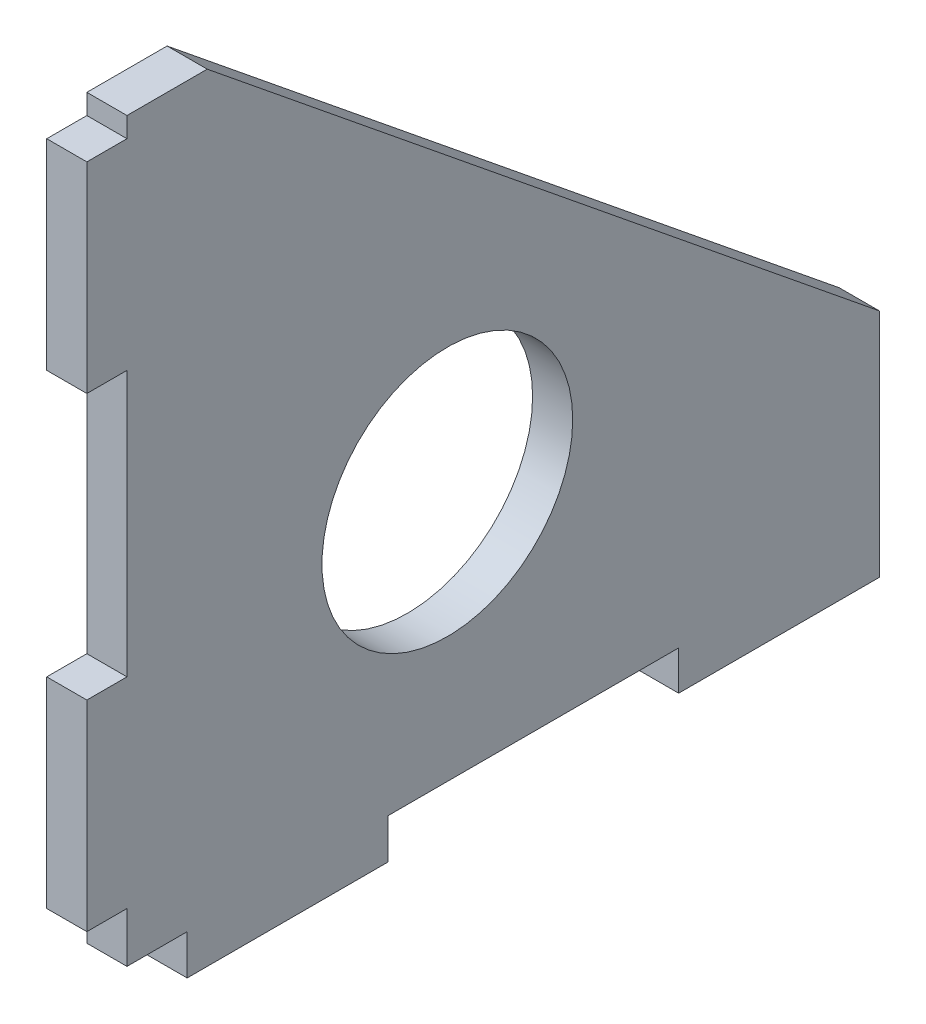
ISO-10303-21;
HEADER;
FILE_DESCRIPTION(('STEP AP214'),'2;1');
FILE_NAME('part.step','',(''),(''),'','','');
FILE_SCHEMA(('AUTOMOTIVE_DESIGN { 1 0 10303 214 1 1 1 1 }'));
ENDSEC;
DATA;
#1=APPLICATION_CONTEXT('core data for automotive mechanical design processes');
#2=APPLICATION_PROTOCOL_DEFINITION('international standard','automotive_design',2000,#1);
#3=PRODUCT_CONTEXT('',#1,'mechanical');
#4=PRODUCT('Part','Part','',(#3));
#5=PRODUCT_RELATED_PRODUCT_CATEGORY('part','',(#4));
#6=PRODUCT_DEFINITION_FORMATION('','',#4);
#7=PRODUCT_DEFINITION_CONTEXT('part definition',#1,'design');
#8=PRODUCT_DEFINITION('design','',#6,#7);
#9=PRODUCT_DEFINITION_SHAPE('','',#8);
#10=(LENGTH_UNIT() NAMED_UNIT(*) SI_UNIT(.MILLI.,.METRE.));
#11=(NAMED_UNIT(*) PLANE_ANGLE_UNIT() SI_UNIT($,.RADIAN.));
#12=(NAMED_UNIT(*) SI_UNIT($,.STERADIAN.) SOLID_ANGLE_UNIT());
#13=UNCERTAINTY_MEASURE_WITH_UNIT(LENGTH_MEASURE(1.E-05),#10,'distance_accuracy_value','');
#14=(GEOMETRIC_REPRESENTATION_CONTEXT(3) GLOBAL_UNCERTAINTY_ASSIGNED_CONTEXT((#13)) GLOBAL_UNIT_ASSIGNED_CONTEXT((#10,
#11,#12)) REPRESENTATION_CONTEXT('',''));
#15=CARTESIAN_POINT('',(0.,0.,0.));
#16=DIRECTION('',(0.,0.,1.));
#17=DIRECTION('',(1.,0.,0.));
#18=AXIS2_PLACEMENT_3D('',#15,#16,#17);
#19=CARTESIAN_POINT('',(4.,0.,0.));
#20=DIRECTION('',(-1.,0.,0.));
#21=DIRECTION('',(0.,0.,1.));
#22=AXIS2_PLACEMENT_3D('',#19,#20,#21);
#23=PLANE('',#22);
#24=DIRECTION('',(0.,0.,1.));
#25=VECTOR('',#24,1.);
#26=CARTESIAN_POINT('',(4.,34.0529513228353,32.145071830835));
#27=LINE('',#26,#25);
#28=CARTESIAN_POINT('',(4.,34.0529513228353,28.145071830835));
#29=VERTEX_POINT('',#28);
#30=CARTESIAN_POINT('',(4.,34.0529513228353,32.145071830835));
#31=VERTEX_POINT('',#30);
#32=EDGE_CURVE('E234',#29,#31,#27,.T.);
#33=ORIENTED_EDGE('',*,*,#32,.T.);
#34=DIRECTION('',(0.,-1.,0.));
#35=VECTOR('',#34,1.);
#36=CARTESIAN_POINT('',(4.,34.0529513228353,32.145071830835));
#37=LINE('',#36,#35);
#38=CARTESIAN_POINT('',(4.,14.0529513228353,32.145071830835));
#39=VERTEX_POINT('',#38);
#40=EDGE_CURVE('E127',#31,#39,#37,.T.);
#41=ORIENTED_EDGE('',*,*,#40,.T.);
#42=DIRECTION('',(0.,0.,-1.));
#43=VECTOR('',#42,1.);
#44=CARTESIAN_POINT('',(4.,14.0529513228353,32.145071830835));
#45=LINE('',#44,#43);
#46=CARTESIAN_POINT('',(4.,14.0529513228353,28.145071830835));
#47=VERTEX_POINT('',#46);
#48=EDGE_CURVE('E282',#39,#47,#45,.T.);
#49=ORIENTED_EDGE('',*,*,#48,.T.);
#50=DIRECTION('',(0.,-1.,0.));
#51=VECTOR('',#50,1.);
#52=CARTESIAN_POINT('',(4.,14.0529513228353,28.145071830835));
#53=LINE('',#52,#51);
#54=CARTESIAN_POINT('',(4.,-12.4097906933287,28.145071830835));
#55=VERTEX_POINT('',#54);
#56=EDGE_CURVE('E301',#47,#55,#53,.T.);
#57=ORIENTED_EDGE('',*,*,#56,.T.);
#58=DIRECTION('',(0.,0.,1.));
#59=VECTOR('',#58,1.);
#60=CARTESIAN_POINT('',(4.,-12.4097906933287,28.145071830835));
#61=LINE('',#60,#59);
#62=CARTESIAN_POINT('',(4.,-12.4097906933287,32.145071830835));
#63=VERTEX_POINT('',#62);
#64=EDGE_CURVE('E298',#55,#63,#61,.T.);
#65=ORIENTED_EDGE('',*,*,#64,.T.);
#66=DIRECTION('',(0.,-1.,0.));
#67=VECTOR('',#66,1.);
#68=CARTESIAN_POINT('',(4.,-12.4097906933287,32.145071830835));
#69=LINE('',#68,#67);
#70=CARTESIAN_POINT('',(4.,-32.4097906933287,32.145071830835));
#71=VERTEX_POINT('',#70);
#72=EDGE_CURVE('E300',#63,#71,#69,.T.);
#73=ORIENTED_EDGE('',*,*,#72,.T.);
#74=DIRECTION('',(0.,0.,-1.));
#75=VECTOR('',#74,1.);
#76=CARTESIAN_POINT('',(4.,-32.4097906933287,32.145071830835));
#77=LINE('',#76,#75);
#78=CARTESIAN_POINT('',(4.,-32.4097906933287,28.145071830835));
#79=VERTEX_POINT('',#78);
#80=EDGE_CURVE('E303',#71,#79,#77,.T.);
#81=ORIENTED_EDGE('',*,*,#80,.T.);
#82=DIRECTION('',(0.,-1.,0.));
#83=VECTOR('',#82,1.);
#84=CARTESIAN_POINT('',(4.,-32.4097906933287,28.145071830835));
#85=LINE('',#84,#83);
#86=CARTESIAN_POINT('',(4.,-37.4097906933287,28.145071830835));
#87=VERTEX_POINT('',#86);
#88=EDGE_CURVE('E309',#79,#87,#85,.T.);
#89=ORIENTED_EDGE('',*,*,#88,.T.);
#90=DIRECTION('',(0.,0.,-1.));
#91=VECTOR('',#90,1.);
#92=CARTESIAN_POINT('',(4.,-37.4097906933287,28.145071830835));
#93=LINE('',#92,#91);
#94=CARTESIAN_POINT('',(4.,-37.4097906933287,22.145071830835));
#95=VERTEX_POINT('',#94);
#96=EDGE_CURVE('E311',#87,#95,#93,.T.);
#97=ORIENTED_EDGE('',*,*,#96,.T.);
#98=DIRECTION('',(0.,-1.,0.));
#99=VECTOR('',#98,1.);
#100=CARTESIAN_POINT('',(4.,-37.4097906933287,22.145071830835));
#101=LINE('',#100,#99);
#102=CARTESIAN_POINT('',(4.,-41.4097906933287,22.145071830835));
#103=VERTEX_POINT('',#102);
#104=EDGE_CURVE('E313',#95,#103,#101,.T.);
#105=ORIENTED_EDGE('',*,*,#104,.T.);
#106=DIRECTION('',(0.,0.,-1.));
#107=VECTOR('',#106,1.);
#108=CARTESIAN_POINT('',(4.,-41.4097906933287,22.145071830835));
#109=LINE('',#108,#107);
#110=CARTESIAN_POINT('',(4.,-41.4097906933287,2.14507183083501));
#111=VERTEX_POINT('',#110);
#112=EDGE_CURVE('E315',#103,#111,#109,.T.);
#113=ORIENTED_EDGE('',*,*,#112,.T.);
#114=DIRECTION('',(0.,1.,0.));
#115=VECTOR('',#114,1.);
#116=CARTESIAN_POINT('',(4.,-41.4097906933287,2.14507183083501));
#117=LINE('',#116,#115);
#118=CARTESIAN_POINT('',(4.,-37.4097906933287,2.14507183083501));
#119=VERTEX_POINT('',#118);
#120=EDGE_CURVE('E317',#111,#119,#117,.T.);
#121=ORIENTED_EDGE('',*,*,#120,.T.);
#122=DIRECTION('',(0.,0.,-1.));
#123=VECTOR('',#122,1.);
#124=CARTESIAN_POINT('',(4.,-37.4097906933287,2.14507183083501));
#125=LINE('',#124,#123);
#126=CARTESIAN_POINT('',(4.,-37.4097906933287,-26.854928169165));
#127=VERTEX_POINT('',#126);
#128=EDGE_CURVE('E319',#119,#127,#125,.T.);
#129=ORIENTED_EDGE('',*,*,#128,.T.);
#130=DIRECTION('',(0.,-1.,0.));
#131=VECTOR('',#130,1.);
#132=CARTESIAN_POINT('',(4.,-37.4097906933287,-26.854928169165));
#133=LINE('',#132,#131);
#134=CARTESIAN_POINT('',(4.,-41.3226718184951,-26.854928169165));
#135=VERTEX_POINT('',#134);
#136=EDGE_CURVE('E321',#127,#135,#133,.T.);
#137=ORIENTED_EDGE('',*,*,#136,.T.);
#138=DIRECTION('',(0.,0.,-1.));
#139=VECTOR('',#138,1.);
#140=CARTESIAN_POINT('',(4.,-41.3226718184951,-26.854928169165));
#141=LINE('',#140,#139);
#142=CARTESIAN_POINT('',(4.,-41.3226718184951,-46.854928169165));
#143=VERTEX_POINT('',#142);
#144=EDGE_CURVE('E323',#135,#143,#141,.T.);
#145=ORIENTED_EDGE('',*,*,#144,.T.);
#146=DIRECTION('',(0.,1.,0.));
#147=VECTOR('',#146,1.);
#148=CARTESIAN_POINT('',(4.,-41.3226718184951,-46.854928169165));
#149=LINE('',#148,#147);
#150=CARTESIAN_POINT('',(4.,-18.3086322954986,-46.854928169165));
#151=VERTEX_POINT('',#150);
#152=EDGE_CURVE('E179',#143,#151,#149,.T.);
#153=ORIENTED_EDGE('',*,*,#152,.T.);
#154=DIRECTION('',(0.,0.630091001553816,0.776521300262207));
#155=VECTOR('',#154,1.);
#156=CARTESIAN_POINT('',(4.,-18.3086322954986,-46.854928169165));
#157=LINE('',#156,#155);
#158=CARTESIAN_POINT('',(4.,36.0570329990022,20.145071830835));
#159=VERTEX_POINT('',#158);
#160=EDGE_CURVE('E173',#151,#159,#157,.T.);
#161=ORIENTED_EDGE('',*,*,#160,.T.);
#162=DIRECTION('',(0.,0.,1.));
#163=VECTOR('',#162,1.);
#164=CARTESIAN_POINT('',(4.,36.0570329990022,28.145071830835));
#165=LINE('',#164,#163);
#166=CARTESIAN_POINT('',(4.,36.0570329990022,28.145071830835));
#167=VERTEX_POINT('',#166);
#168=EDGE_CURVE('E177',#159,#167,#165,.T.);
#169=ORIENTED_EDGE('',*,*,#168,.T.);
#170=DIRECTION('',(0.,-1.,0.));
#171=VECTOR('',#170,1.);
#172=CARTESIAN_POINT('',(4.,36.0570329990022,28.145071830835));
#173=LINE('',#172,#171);
#174=EDGE_CURVE('E51',#167,#29,#173,.T.);
#175=ORIENTED_EDGE('',*,*,#174,.T.);
#176=EDGE_LOOP('',(#33,#41,#49,#57,#65,#73,#81,#89,#97,#105,#113,#121,#129,#137,#145,#153,#161,
#169,#175));
#177=FACE_BOUND('',#176,.T.);
#178=CARTESIAN_POINT('',(4.,-12.4097906933287,-3.79377047219465));
#179=DIRECTION('',(1.,0.,0.));
#180=DIRECTION('',(0.,0.,-1.));
#181=AXIS2_PLACEMENT_3D('',#178,#179,#180);
#182=CIRCLE('',#181,12.5);
#183=CARTESIAN_POINT('',(4.,-12.4097906933287,-16.2937704721947));
#184=VERTEX_POINT('',#183);
#185=EDGE_CURVE('E201',#184,#184,#182,.T.);
#186=ORIENTED_EDGE('',*,*,#185,.F.);
#187=EDGE_LOOP('',(#186));
#188=FACE_BOUND('',#187,.T.);
#189=ADVANCED_FACE('F34',(#177,#188),#23,.F.);
#190=CARTESIAN_POINT('',(0.,0.,0.));
#191=DIRECTION('',(-1.,0.,0.));
#192=DIRECTION('',(0.,0.,1.));
#193=AXIS2_PLACEMENT_3D('',#190,#191,#192);
#194=PLANE('',#193);
#195=DIRECTION('',(0.,0.,1.));
#196=VECTOR('',#195,1.);
#197=CARTESIAN_POINT('',(0.,34.0529513228353,32.145071830835));
#198=LINE('',#197,#196);
#199=CARTESIAN_POINT('',(0.,34.0529513228353,28.145071830835));
#200=VERTEX_POINT('',#199);
#201=CARTESIAN_POINT('',(0.,34.0529513228353,32.145071830835));
#202=VERTEX_POINT('',#201);
#203=EDGE_CURVE('E197',#200,#202,#198,.T.);
#204=ORIENTED_EDGE('',*,*,#203,.F.);
#205=DIRECTION('',(0.,-1.,0.));
#206=VECTOR('',#205,1.);
#207=CARTESIAN_POINT('',(0.,36.0570329990022,28.145071830835));
#208=LINE('',#207,#206);
#209=CARTESIAN_POINT('',(0.,36.0570329990022,28.145071830835));
#210=VERTEX_POINT('',#209);
#211=EDGE_CURVE('E119',#210,#200,#208,.T.);
#212=ORIENTED_EDGE('',*,*,#211,.F.);
#213=DIRECTION('',(0.,0.,1.));
#214=VECTOR('',#213,1.);
#215=CARTESIAN_POINT('',(0.,36.0570329990022,28.145071830835));
#216=LINE('',#215,#214);
#217=CARTESIAN_POINT('',(0.,36.0570329990022,20.145071830835));
#218=VERTEX_POINT('',#217);
#219=EDGE_CURVE('E113',#218,#210,#216,.T.);
#220=ORIENTED_EDGE('',*,*,#219,.F.);
#221=DIRECTION('',(0.,0.630091001553816,0.776521300262207));
#222=VECTOR('',#221,1.);
#223=CARTESIAN_POINT('',(0.,-18.3086322954986,-46.854928169165));
#224=LINE('',#223,#222);
#225=CARTESIAN_POINT('',(0.,-18.3086322954986,-46.854928169165));
#226=VERTEX_POINT('',#225);
#227=EDGE_CURVE('E187',#226,#218,#224,.T.);
#228=ORIENTED_EDGE('',*,*,#227,.F.);
#229=DIRECTION('',(0.,1.,0.));
#230=VECTOR('',#229,1.);
#231=CARTESIAN_POINT('',(0.,-41.3226718184951,-46.854928169165));
#232=LINE('',#231,#230);
#233=CARTESIAN_POINT('',(0.,-41.3226718184951,-46.854928169165));
#234=VERTEX_POINT('',#233);
#235=EDGE_CURVE('E229',#234,#226,#232,.T.);
#236=ORIENTED_EDGE('',*,*,#235,.F.);
#237=DIRECTION('',(0.,0.,-1.));
#238=VECTOR('',#237,1.);
#239=CARTESIAN_POINT('',(0.,-41.3226718184951,-26.854928169165));
#240=LINE('',#239,#238);
#241=CARTESIAN_POINT('',(0.,-41.3226718184951,-26.854928169165));
#242=VERTEX_POINT('',#241);
#243=EDGE_CURVE('E227',#242,#234,#240,.T.);
#244=ORIENTED_EDGE('',*,*,#243,.F.);
#245=DIRECTION('',(0.,-1.,0.));
#246=VECTOR('',#245,1.);
#247=CARTESIAN_POINT('',(0.,-37.4097906933287,-26.854928169165));
#248=LINE('',#247,#246);
#249=CARTESIAN_POINT('',(0.,-37.4097906933287,-26.854928169165));
#250=VERTEX_POINT('',#249);
#251=EDGE_CURVE('E225',#250,#242,#248,.T.);
#252=ORIENTED_EDGE('',*,*,#251,.F.);
#253=DIRECTION('',(0.,0.,-1.));
#254=VECTOR('',#253,1.);
#255=CARTESIAN_POINT('',(0.,-37.4097906933287,2.14507183083501));
#256=LINE('',#255,#254);
#257=CARTESIAN_POINT('',(0.,-37.4097906933287,2.14507183083501));
#258=VERTEX_POINT('',#257);
#259=EDGE_CURVE('E223',#258,#250,#256,.T.);
#260=ORIENTED_EDGE('',*,*,#259,.F.);
#261=DIRECTION('',(0.,1.,0.));
#262=VECTOR('',#261,1.);
#263=CARTESIAN_POINT('',(0.,-41.4097906933287,2.14507183083501));
#264=LINE('',#263,#262);
#265=CARTESIAN_POINT('',(0.,-41.4097906933287,2.14507183083501));
#266=VERTEX_POINT('',#265);
#267=EDGE_CURVE('E221',#266,#258,#264,.T.);
#268=ORIENTED_EDGE('',*,*,#267,.F.);
#269=DIRECTION('',(0.,0.,-1.));
#270=VECTOR('',#269,1.);
#271=CARTESIAN_POINT('',(0.,-41.4097906933287,22.145071830835));
#272=LINE('',#271,#270);
#273=CARTESIAN_POINT('',(0.,-41.4097906933287,22.145071830835));
#274=VERTEX_POINT('',#273);
#275=EDGE_CURVE('E219',#274,#266,#272,.T.);
#276=ORIENTED_EDGE('',*,*,#275,.F.);
#277=DIRECTION('',(0.,-1.,0.));
#278=VECTOR('',#277,1.);
#279=CARTESIAN_POINT('',(0.,-37.4097906933287,22.145071830835));
#280=LINE('',#279,#278);
#281=CARTESIAN_POINT('',(0.,-37.4097906933287,22.145071830835));
#282=VERTEX_POINT('',#281);
#283=EDGE_CURVE('E217',#282,#274,#280,.T.);
#284=ORIENTED_EDGE('',*,*,#283,.F.);
#285=DIRECTION('',(0.,0.,-1.));
#286=VECTOR('',#285,1.);
#287=CARTESIAN_POINT('',(0.,-37.4097906933287,28.145071830835));
#288=LINE('',#287,#286);
#289=CARTESIAN_POINT('',(0.,-37.4097906933287,28.145071830835));
#290=VERTEX_POINT('',#289);
#291=EDGE_CURVE('E215',#290,#282,#288,.T.);
#292=ORIENTED_EDGE('',*,*,#291,.F.);
#293=DIRECTION('',(0.,-1.,0.));
#294=VECTOR('',#293,1.);
#295=CARTESIAN_POINT('',(0.,-32.4097906933287,28.145071830835));
#296=LINE('',#295,#294);
#297=CARTESIAN_POINT('',(0.,-32.4097906933287,28.145071830835));
#298=VERTEX_POINT('',#297);
#299=EDGE_CURVE('E213',#298,#290,#296,.T.);
#300=ORIENTED_EDGE('',*,*,#299,.F.);
#301=DIRECTION('',(0.,0.,-1.));
#302=VECTOR('',#301,1.);
#303=CARTESIAN_POINT('',(0.,-32.4097906933287,32.145071830835));
#304=LINE('',#303,#302);
#305=CARTESIAN_POINT('',(0.,-32.4097906933287,32.145071830835));
#306=VERTEX_POINT('',#305);
#307=EDGE_CURVE('E211',#306,#298,#304,.T.);
#308=ORIENTED_EDGE('',*,*,#307,.F.);
#309=DIRECTION('',(0.,-1.,0.));
#310=VECTOR('',#309,1.);
#311=CARTESIAN_POINT('',(0.,-12.4097906933287,32.145071830835));
#312=LINE('',#311,#310);
#313=CARTESIAN_POINT('',(0.,-12.4097906933287,32.145071830835));
#314=VERTEX_POINT('',#313);
#315=EDGE_CURVE('E209',#314,#306,#312,.T.);
#316=ORIENTED_EDGE('',*,*,#315,.F.);
#317=DIRECTION('',(0.,0.,1.));
#318=VECTOR('',#317,1.);
#319=CARTESIAN_POINT('',(0.,-12.4097906933287,28.145071830835));
#320=LINE('',#319,#318);
#321=CARTESIAN_POINT('',(0.,-12.4097906933287,28.145071830835));
#322=VERTEX_POINT('',#321);
#323=EDGE_CURVE('E207',#322,#314,#320,.T.);
#324=ORIENTED_EDGE('',*,*,#323,.F.);
#325=DIRECTION('',(0.,-1.,0.));
#326=VECTOR('',#325,1.);
#327=CARTESIAN_POINT('',(0.,14.0529513228353,28.145071830835));
#328=LINE('',#327,#326);
#329=CARTESIAN_POINT('',(0.,14.0529513228353,28.145071830835));
#330=VERTEX_POINT('',#329);
#331=EDGE_CURVE('E205',#330,#322,#328,.T.);
#332=ORIENTED_EDGE('',*,*,#331,.F.);
#333=DIRECTION('',(0.,0.,-1.));
#334=VECTOR('',#333,1.);
#335=CARTESIAN_POINT('',(0.,14.0529513228353,32.145071830835));
#336=LINE('',#335,#334);
#337=CARTESIAN_POINT('',(0.,14.0529513228353,32.145071830835));
#338=VERTEX_POINT('',#337);
#339=EDGE_CURVE('E203',#338,#330,#336,.T.);
#340=ORIENTED_EDGE('',*,*,#339,.F.);
#341=DIRECTION('',(0.,-1.,0.));
#342=VECTOR('',#341,1.);
#343=CARTESIAN_POINT('',(0.,34.0529513228353,32.145071830835));
#344=LINE('',#343,#342);
#345=EDGE_CURVE('E200',#202,#338,#344,.T.);
#346=ORIENTED_EDGE('',*,*,#345,.F.);
#347=EDGE_LOOP('',(#204,#212,#220,#228,#236,#244,#252,#260,#268,#276,#284,#292,#300,#308,#316,
#324,#332,#340,#346));
#348=FACE_BOUND('',#347,.T.);
#349=CARTESIAN_POINT('',(0.,-12.4097906933287,-3.79377047219465));
#350=DIRECTION('',(1.,0.,0.));
#351=DIRECTION('',(0.,0.,-1.));
#352=AXIS2_PLACEMENT_3D('',#349,#350,#351);
#353=CIRCLE('',#352,12.5);
#354=CARTESIAN_POINT('',(0.,-12.4097906933287,-16.2937704721947));
#355=VERTEX_POINT('',#354);
#356=EDGE_CURVE('E561',#355,#355,#353,.T.);
#357=ORIENTED_EDGE('',*,*,#356,.T.);
#358=EDGE_LOOP('',(#357));
#359=FACE_BOUND('',#358,.T.);
#360=ADVANCED_FACE('F286',(#348,#359),#194,.T.);
#361=CARTESIAN_POINT('',(4.,34.0529513228353,32.145071830835));
#362=DIRECTION('',(0.,-1.,0.));
#363=DIRECTION('',(0.,0.,-1.));
#364=AXIS2_PLACEMENT_3D('',#361,#362,#363);
#365=PLANE('',#364);
#366=ORIENTED_EDGE('',*,*,#203,.T.);
#367=DIRECTION('',(-1.,0.,0.));
#368=VECTOR('',#367,1.);
#369=CARTESIAN_POINT('',(4.,34.0529513228353,32.145071830835));
#370=LINE('',#369,#368);
#371=EDGE_CURVE('E11',#31,#202,#370,.T.);
#372=ORIENTED_EDGE('',*,*,#371,.F.);
#373=ORIENTED_EDGE('',*,*,#32,.F.);
#374=DIRECTION('',(-1.,0.,0.));
#375=VECTOR('',#374,1.);
#376=CARTESIAN_POINT('',(4.,34.0529513228353,28.145071830835));
#377=LINE('',#376,#375);
#378=EDGE_CURVE('E193',#29,#200,#377,.T.);
#379=ORIENTED_EDGE('',*,*,#378,.T.);
#380=EDGE_LOOP('',(#366,#372,#373,#379));
#381=FACE_BOUND('',#380,.T.);
#382=ADVANCED_FACE('F36',(#381),#365,.F.);
#383=CARTESIAN_POINT('',(4.,34.0529513228353,32.145071830835));
#384=DIRECTION('',(0.,0.,-1.));
#385=DIRECTION('',(-1.,0.,0.));
#386=AXIS2_PLACEMENT_3D('',#383,#384,#385);
#387=PLANE('',#386);
#388=ORIENTED_EDGE('',*,*,#345,.T.);
#389=DIRECTION('',(-1.,0.,0.));
#390=VECTOR('',#389,1.);
#391=CARTESIAN_POINT('',(4.,14.0529513228353,32.145071830835));
#392=LINE('',#391,#390);
#393=EDGE_CURVE('E43',#39,#338,#392,.T.);
#394=ORIENTED_EDGE('',*,*,#393,.F.);
#395=ORIENTED_EDGE('',*,*,#40,.F.);
#396=ORIENTED_EDGE('',*,*,#371,.T.);
#397=EDGE_LOOP('',(#388,#394,#395,#396));
#398=FACE_BOUND('',#397,.T.);
#399=ADVANCED_FACE('F357',(#398),#387,.F.);
#400=CARTESIAN_POINT('',(4.,14.0529513228353,32.145071830835));
#401=DIRECTION('',(0.,1.,0.));
#402=DIRECTION('',(0.,0.,1.));
#403=AXIS2_PLACEMENT_3D('',#400,#401,#402);
#404=PLANE('',#403);
#405=ORIENTED_EDGE('',*,*,#339,.T.);
#406=DIRECTION('',(-1.,0.,0.));
#407=VECTOR('',#406,1.);
#408=CARTESIAN_POINT('',(4.,14.0529513228353,28.145071830835));
#409=LINE('',#408,#407);
#410=EDGE_CURVE('E274',#47,#330,#409,.T.);
#411=ORIENTED_EDGE('',*,*,#410,.F.);
#412=ORIENTED_EDGE('',*,*,#48,.F.);
#413=ORIENTED_EDGE('',*,*,#393,.T.);
#414=EDGE_LOOP('',(#405,#411,#412,#413));
#415=FACE_BOUND('',#414,.T.);
#416=ADVANCED_FACE('F280',(#415),#404,.F.);
#417=CARTESIAN_POINT('',(4.,14.0529513228353,28.145071830835));
#418=DIRECTION('',(0.,0.,-1.));
#419=DIRECTION('',(0.,1.,0.));
#420=AXIS2_PLACEMENT_3D('',#417,#418,#419);
#421=PLANE('',#420);
#422=ORIENTED_EDGE('',*,*,#331,.T.);
#423=DIRECTION('',(-1.,0.,0.));
#424=VECTOR('',#423,1.);
#425=CARTESIAN_POINT('',(4.,-12.4097906933287,28.145071830835));
#426=LINE('',#425,#424);
#427=EDGE_CURVE('E271',#55,#322,#426,.T.);
#428=ORIENTED_EDGE('',*,*,#427,.F.);
#429=ORIENTED_EDGE('',*,*,#56,.F.);
#430=ORIENTED_EDGE('',*,*,#410,.T.);
#431=EDGE_LOOP('',(#422,#428,#429,#430));
#432=FACE_BOUND('',#431,.T.);
#433=ADVANCED_FACE('F292',(#432),#421,.F.);
#434=CARTESIAN_POINT('',(4.,-12.4097906933287,28.145071830835));
#435=DIRECTION('',(0.,-1.,0.));
#436=DIRECTION('',(0.,0.,-1.));
#437=AXIS2_PLACEMENT_3D('',#434,#435,#436);
#438=PLANE('',#437);
#439=ORIENTED_EDGE('',*,*,#323,.T.);
#440=DIRECTION('',(-1.,0.,0.));
#441=VECTOR('',#440,1.);
#442=CARTESIAN_POINT('',(4.,-12.4097906933287,32.145071830835));
#443=LINE('',#442,#441);
#444=EDGE_CURVE('E268',#63,#314,#443,.T.);
#445=ORIENTED_EDGE('',*,*,#444,.F.);
#446=ORIENTED_EDGE('',*,*,#64,.F.);
#447=ORIENTED_EDGE('',*,*,#427,.T.);
#448=EDGE_LOOP('',(#439,#445,#446,#447));
#449=FACE_BOUND('',#448,.T.);
#450=ADVANCED_FACE('F296',(#449),#438,.F.);
#451=CARTESIAN_POINT('',(4.,-12.4097906933287,32.145071830835));
#452=DIRECTION('',(0.,0.,-1.));
#453=DIRECTION('',(-1.,0.,0.));
#454=AXIS2_PLACEMENT_3D('',#451,#452,#453);
#455=PLANE('',#454);
#456=ORIENTED_EDGE('',*,*,#315,.T.);
#457=DIRECTION('',(-1.,0.,0.));
#458=VECTOR('',#457,1.);
#459=CARTESIAN_POINT('',(4.,-32.4097906933287,32.145071830835));
#460=LINE('',#459,#458);
#461=EDGE_CURVE('E265',#71,#306,#460,.T.);
#462=ORIENTED_EDGE('',*,*,#461,.F.);
#463=ORIENTED_EDGE('',*,*,#72,.F.);
#464=ORIENTED_EDGE('',*,*,#444,.T.);
#465=EDGE_LOOP('',(#456,#462,#463,#464));
#466=FACE_BOUND('',#465,.T.);
#467=ADVANCED_FACE('F370',(#466),#455,.F.);
#468=CARTESIAN_POINT('',(4.,-32.4097906933287,32.145071830835));
#469=DIRECTION('',(0.,1.,0.));
#470=DIRECTION('',(0.,0.,1.));
#471=AXIS2_PLACEMENT_3D('',#468,#469,#470);
#472=PLANE('',#471);
#473=ORIENTED_EDGE('',*,*,#307,.T.);
#474=DIRECTION('',(-1.,0.,0.));
#475=VECTOR('',#474,1.);
#476=CARTESIAN_POINT('',(4.,-32.4097906933287,28.145071830835));
#477=LINE('',#476,#475);
#478=EDGE_CURVE('E262',#79,#298,#477,.T.);
#479=ORIENTED_EDGE('',*,*,#478,.F.);
#480=ORIENTED_EDGE('',*,*,#80,.F.);
#481=ORIENTED_EDGE('',*,*,#461,.T.);
#482=EDGE_LOOP('',(#473,#479,#480,#481));
#483=FACE_BOUND('',#482,.T.);
#484=ADVANCED_FACE('F373',(#483),#472,.F.);
#485=CARTESIAN_POINT('',(4.,-32.4097906933287,28.145071830835));
#486=DIRECTION('',(0.,0.,-1.));
#487=DIRECTION('',(-1.,0.,0.));
#488=AXIS2_PLACEMENT_3D('',#485,#486,#487);
#489=PLANE('',#488);
#490=ORIENTED_EDGE('',*,*,#299,.T.);
#491=DIRECTION('',(-1.,0.,0.));
#492=VECTOR('',#491,1.);
#493=CARTESIAN_POINT('',(4.,-37.4097906933287,28.145071830835));
#494=LINE('',#493,#492);
#495=EDGE_CURVE('E259',#87,#290,#494,.T.);
#496=ORIENTED_EDGE('',*,*,#495,.F.);
#497=ORIENTED_EDGE('',*,*,#88,.F.);
#498=ORIENTED_EDGE('',*,*,#478,.T.);
#499=EDGE_LOOP('',(#490,#496,#497,#498));
#500=FACE_BOUND('',#499,.T.);
#501=ADVANCED_FACE('F377',(#500),#489,.F.);
#502=CARTESIAN_POINT('',(4.,-37.4097906933287,28.145071830835));
#503=DIRECTION('',(0.,1.,0.));
#504=DIRECTION('',(0.,0.,1.));
#505=AXIS2_PLACEMENT_3D('',#502,#503,#504);
#506=PLANE('',#505);
#507=ORIENTED_EDGE('',*,*,#291,.T.);
#508=DIRECTION('',(-1.,0.,0.));
#509=VECTOR('',#508,1.);
#510=CARTESIAN_POINT('',(4.,-37.4097906933287,22.145071830835));
#511=LINE('',#510,#509);
#512=EDGE_CURVE('E256',#95,#282,#511,.T.);
#513=ORIENTED_EDGE('',*,*,#512,.F.);
#514=ORIENTED_EDGE('',*,*,#96,.F.);
#515=ORIENTED_EDGE('',*,*,#495,.T.);
#516=EDGE_LOOP('',(#507,#513,#514,#515));
#517=FACE_BOUND('',#516,.T.);
#518=ADVANCED_FACE('F381',(#517),#506,.F.);
#519=CARTESIAN_POINT('',(4.,-37.4097906933287,22.145071830835));
#520=DIRECTION('',(0.,0.,-1.));
#521=DIRECTION('',(-1.,0.,0.));
#522=AXIS2_PLACEMENT_3D('',#519,#520,#521);
#523=PLANE('',#522);
#524=ORIENTED_EDGE('',*,*,#283,.T.);
#525=DIRECTION('',(-1.,0.,0.));
#526=VECTOR('',#525,1.);
#527=CARTESIAN_POINT('',(4.,-41.4097906933287,22.145071830835));
#528=LINE('',#527,#526);
#529=EDGE_CURVE('E253',#103,#274,#528,.T.);
#530=ORIENTED_EDGE('',*,*,#529,.F.);
#531=ORIENTED_EDGE('',*,*,#104,.F.);
#532=ORIENTED_EDGE('',*,*,#512,.T.);
#533=EDGE_LOOP('',(#524,#530,#531,#532));
#534=FACE_BOUND('',#533,.T.);
#535=ADVANCED_FACE('F385',(#534),#523,.F.);
#536=CARTESIAN_POINT('',(4.,-41.4097906933287,22.145071830835));
#537=DIRECTION('',(0.,1.,0.));
#538=DIRECTION('',(0.,0.,1.));
#539=AXIS2_PLACEMENT_3D('',#536,#537,#538);
#540=PLANE('',#539);
#541=ORIENTED_EDGE('',*,*,#275,.T.);
#542=DIRECTION('',(-1.,0.,0.));
#543=VECTOR('',#542,1.);
#544=CARTESIAN_POINT('',(4.,-41.4097906933287,2.14507183083501));
#545=LINE('',#544,#543);
#546=EDGE_CURVE('E250',#111,#266,#545,.T.);
#547=ORIENTED_EDGE('',*,*,#546,.F.);
#548=ORIENTED_EDGE('',*,*,#112,.F.);
#549=ORIENTED_EDGE('',*,*,#529,.T.);
#550=EDGE_LOOP('',(#541,#547,#548,#549));
#551=FACE_BOUND('',#550,.T.);
#552=ADVANCED_FACE('F389',(#551),#540,.F.);
#553=CARTESIAN_POINT('',(4.,-41.4097906933287,2.14507183083501));
#554=DIRECTION('',(0.,0.,1.));
#555=DIRECTION('',(1.,0.,0.));
#556=AXIS2_PLACEMENT_3D('',#553,#554,#555);
#557=PLANE('',#556);
#558=ORIENTED_EDGE('',*,*,#267,.T.);
#559=DIRECTION('',(-1.,0.,0.));
#560=VECTOR('',#559,1.);
#561=CARTESIAN_POINT('',(4.,-37.4097906933287,2.14507183083501));
#562=LINE('',#561,#560);
#563=EDGE_CURVE('E247',#119,#258,#562,.T.);
#564=ORIENTED_EDGE('',*,*,#563,.F.);
#565=ORIENTED_EDGE('',*,*,#120,.F.);
#566=ORIENTED_EDGE('',*,*,#546,.T.);
#567=EDGE_LOOP('',(#558,#564,#565,#566));
#568=FACE_BOUND('',#567,.T.);
#569=ADVANCED_FACE('F393',(#568),#557,.F.);
#570=CARTESIAN_POINT('',(4.,-37.4097906933287,2.14507183083501));
#571=DIRECTION('',(0.,1.,0.));
#572=DIRECTION('',(0.,0.,1.));
#573=AXIS2_PLACEMENT_3D('',#570,#571,#572);
#574=PLANE('',#573);
#575=ORIENTED_EDGE('',*,*,#259,.T.);
#576=DIRECTION('',(-1.,0.,0.));
#577=VECTOR('',#576,1.);
#578=CARTESIAN_POINT('',(4.,-37.4097906933287,-26.854928169165));
#579=LINE('',#578,#577);
#580=EDGE_CURVE('E244',#127,#250,#579,.T.);
#581=ORIENTED_EDGE('',*,*,#580,.F.);
#582=ORIENTED_EDGE('',*,*,#128,.F.);
#583=ORIENTED_EDGE('',*,*,#563,.T.);
#584=EDGE_LOOP('',(#575,#581,#582,#583));
#585=FACE_BOUND('',#584,.T.);
#586=ADVANCED_FACE('F397',(#585),#574,.F.);
#587=CARTESIAN_POINT('',(4.,-37.4097906933287,-26.854928169165));
#588=DIRECTION('',(0.,0.,-1.));
#589=DIRECTION('',(-1.,0.,0.));
#590=AXIS2_PLACEMENT_3D('',#587,#588,#589);
#591=PLANE('',#590);
#592=ORIENTED_EDGE('',*,*,#251,.T.);
#593=DIRECTION('',(-1.,0.,0.));
#594=VECTOR('',#593,1.);
#595=CARTESIAN_POINT('',(4.,-41.3226718184951,-26.854928169165));
#596=LINE('',#595,#594);
#597=EDGE_CURVE('E241',#135,#242,#596,.T.);
#598=ORIENTED_EDGE('',*,*,#597,.F.);
#599=ORIENTED_EDGE('',*,*,#136,.F.);
#600=ORIENTED_EDGE('',*,*,#580,.T.);
#601=EDGE_LOOP('',(#592,#598,#599,#600));
#602=FACE_BOUND('',#601,.T.);
#603=ADVANCED_FACE('F401',(#602),#591,.F.);
#604=CARTESIAN_POINT('',(4.,-41.3226718184951,-26.854928169165));
#605=DIRECTION('',(0.,1.,0.));
#606=DIRECTION('',(0.,0.,1.));
#607=AXIS2_PLACEMENT_3D('',#604,#605,#606);
#608=PLANE('',#607);
#609=ORIENTED_EDGE('',*,*,#243,.T.);
#610=DIRECTION('',(-1.,0.,0.));
#611=VECTOR('',#610,1.);
#612=CARTESIAN_POINT('',(4.,-41.3226718184951,-46.854928169165));
#613=LINE('',#612,#611);
#614=EDGE_CURVE('E238',#143,#234,#613,.T.);
#615=ORIENTED_EDGE('',*,*,#614,.F.);
#616=ORIENTED_EDGE('',*,*,#144,.F.);
#617=ORIENTED_EDGE('',*,*,#597,.T.);
#618=EDGE_LOOP('',(#609,#615,#616,#617));
#619=FACE_BOUND('',#618,.T.);
#620=ADVANCED_FACE('F329',(#619),#608,.F.);
#621=CARTESIAN_POINT('',(4.,-41.3226718184951,-46.854928169165));
#622=DIRECTION('',(0.,0.,1.));
#623=DIRECTION('',(1.,0.,0.));
#624=AXIS2_PLACEMENT_3D('',#621,#622,#623);
#625=PLANE('',#624);
#626=ORIENTED_EDGE('',*,*,#235,.T.);
#627=DIRECTION('',(-1.,0.,0.));
#628=VECTOR('',#627,1.);
#629=CARTESIAN_POINT('',(4.,-18.3086322954986,-46.854928169165));
#630=LINE('',#629,#628);
#631=EDGE_CURVE('E188',#151,#226,#630,.T.);
#632=ORIENTED_EDGE('',*,*,#631,.F.);
#633=ORIENTED_EDGE('',*,*,#152,.F.);
#634=ORIENTED_EDGE('',*,*,#614,.T.);
#635=EDGE_LOOP('',(#626,#632,#633,#634));
#636=FACE_BOUND('',#635,.T.);
#637=ADVANCED_FACE('F333',(#636),#625,.F.);
#638=CARTESIAN_POINT('',(4.,-18.3086322954986,-46.854928169165));
#639=DIRECTION('',(0.,-0.776521300262207,0.630091001553816));
#640=DIRECTION('',(0.,-0.630091001553816,-0.776521300262207));
#641=AXIS2_PLACEMENT_3D('',#638,#639,#640);
#642=PLANE('',#641);
#643=ORIENTED_EDGE('',*,*,#227,.T.);
#644=DIRECTION('',(-1.,0.,0.));
#645=VECTOR('',#644,1.);
#646=CARTESIAN_POINT('',(4.,36.0570329990022,20.145071830835));
#647=LINE('',#646,#645);
#648=EDGE_CURVE('E184',#159,#218,#647,.T.);
#649=ORIENTED_EDGE('',*,*,#648,.F.);
#650=ORIENTED_EDGE('',*,*,#160,.F.);
#651=ORIENTED_EDGE('',*,*,#631,.T.);
#652=EDGE_LOOP('',(#643,#649,#650,#651));
#653=FACE_BOUND('',#652,.T.);
#654=ADVANCED_FACE('F185',(#653),#642,.F.);
#655=CARTESIAN_POINT('',(4.,36.0570329990022,28.145071830835));
#656=DIRECTION('',(0.,-1.,0.));
#657=DIRECTION('',(0.,0.,-1.));
#658=AXIS2_PLACEMENT_3D('',#655,#656,#657);
#659=PLANE('',#658);
#660=ORIENTED_EDGE('',*,*,#219,.T.);
#661=DIRECTION('',(-1.,0.,0.));
#662=VECTOR('',#661,1.);
#663=CARTESIAN_POINT('',(4.,36.0570329990022,28.145071830835));
#664=LINE('',#663,#662);
#665=EDGE_CURVE('E189',#167,#210,#664,.T.);
#666=ORIENTED_EDGE('',*,*,#665,.F.);
#667=ORIENTED_EDGE('',*,*,#168,.F.);
#668=ORIENTED_EDGE('',*,*,#648,.T.);
#669=EDGE_LOOP('',(#660,#666,#667,#668));
#670=FACE_BOUND('',#669,.T.);
#671=ADVANCED_FACE('F191',(#670),#659,.F.);
#672=CARTESIAN_POINT('',(4.,36.0570329990022,28.145071830835));
#673=DIRECTION('',(0.,0.,-1.));
#674=DIRECTION('',(-1.,0.,0.));
#675=AXIS2_PLACEMENT_3D('',#672,#673,#674);
#676=PLANE('',#675);
#677=ORIENTED_EDGE('',*,*,#211,.T.);
#678=ORIENTED_EDGE('',*,*,#378,.F.);
#679=ORIENTED_EDGE('',*,*,#174,.F.);
#680=ORIENTED_EDGE('',*,*,#665,.T.);
#681=EDGE_LOOP('',(#677,#678,#679,#680));
#682=FACE_BOUND('',#681,.T.);
#683=ADVANCED_FACE('F337',(#682),#676,.F.);
#684=CARTESIAN_POINT('',(4.,-12.4097906933287,-3.79377047219465));
#685=DIRECTION('',(-1.,0.,0.));
#686=DIRECTION('',(0.,0.,1.));
#687=AXIS2_PLACEMENT_3D('',#684,#685,#686);
#688=CYLINDRICAL_SURFACE('',#687,12.5);
#689=ORIENTED_EDGE('',*,*,#185,.T.);
#690=EDGE_LOOP('',(#689));
#691=FACE_BOUND('',#690,.T.);
#692=ORIENTED_EDGE('',*,*,#356,.F.);
#693=EDGE_LOOP('',(#692));
#694=FACE_BOUND('',#693,.T.);
#695=ADVANCED_FACE('F339',(#691,#694),#688,.F.);
#696=CLOSED_SHELL('',(#189,#360,#382,#399,#416,#433,#450,#467,#484,#501,#518,#535,#552,#569,
#586,#603,#620,#637,#654,#671,#683,#695));
#697=MANIFOLD_SOLID_BREP('B2',#696);
#698=ADVANCED_BREP_SHAPE_REPRESENTATION('',(#18,#697),#14);
#699=SHAPE_DEFINITION_REPRESENTATION(#9,#698);
ENDSEC;
END-ISO-10303-21;
